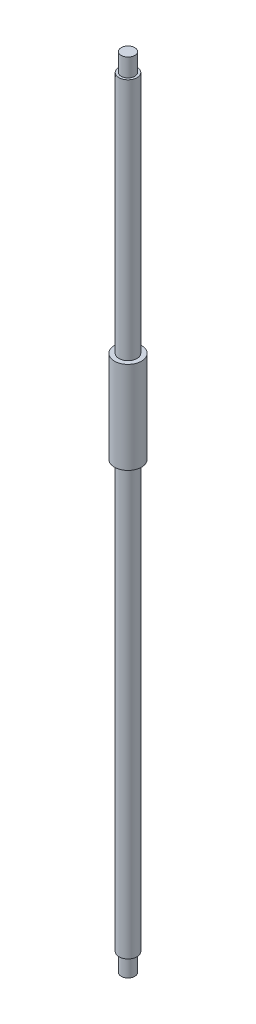
ISO-10303-21;
HEADER;
FILE_DESCRIPTION(('STEP AP214'),'2;1');
FILE_NAME('part.step','',(''),(''),'','','');
FILE_SCHEMA(('AUTOMOTIVE_DESIGN { 1 0 10303 214 1 1 1 1 }'));
ENDSEC;
DATA;
#1=APPLICATION_CONTEXT('core data for automotive mechanical design processes');
#2=APPLICATION_PROTOCOL_DEFINITION('international standard','automotive_design',2000,#1);
#3=PRODUCT_CONTEXT('',#1,'mechanical');
#4=PRODUCT('Part','Part','',(#3));
#5=PRODUCT_RELATED_PRODUCT_CATEGORY('part','',(#4));
#6=PRODUCT_DEFINITION_FORMATION('','',#4);
#7=PRODUCT_DEFINITION_CONTEXT('part definition',#1,'design');
#8=PRODUCT_DEFINITION('design','',#6,#7);
#9=PRODUCT_DEFINITION_SHAPE('','',#8);
#10=(LENGTH_UNIT() NAMED_UNIT(*) SI_UNIT(.MILLI.,.METRE.));
#11=(NAMED_UNIT(*) PLANE_ANGLE_UNIT() SI_UNIT($,.RADIAN.));
#12=(NAMED_UNIT(*) SI_UNIT($,.STERADIAN.) SOLID_ANGLE_UNIT());
#13=UNCERTAINTY_MEASURE_WITH_UNIT(LENGTH_MEASURE(1.E-05),#10,'distance_accuracy_value','');
#14=(GEOMETRIC_REPRESENTATION_CONTEXT(3) GLOBAL_UNCERTAINTY_ASSIGNED_CONTEXT((#13)) GLOBAL_UNIT_ASSIGNED_CONTEXT((#10,
#11,#12)) REPRESENTATION_CONTEXT('',''));
#15=CARTESIAN_POINT('',(0.,0.,0.));
#16=DIRECTION('',(0.,0.,1.));
#17=DIRECTION('',(1.,0.,0.));
#18=AXIS2_PLACEMENT_3D('',#15,#16,#17);
#19=CARTESIAN_POINT('',(0.,1120.,0.));
#20=DIRECTION('',(0.,-1.,0.));
#21=DIRECTION('',(0.,0.,-1.));
#22=AXIS2_PLACEMENT_3D('',#19,#20,#21);
#23=CYLINDRICAL_SURFACE('',#22,12.7);
#24=CARTESIAN_POINT('',(0.,25.4,0.));
#25=DIRECTION('',(0.,-1.,0.));
#26=DIRECTION('',(0.,0.,-1.));
#27=AXIS2_PLACEMENT_3D('',#24,#25,#26);
#28=CIRCLE('',#27,12.7);
#29=CARTESIAN_POINT('',(0.,25.4,-12.7));
#30=VERTEX_POINT('',#29);
#31=EDGE_CURVE('E44',#30,#30,#28,.T.);
#32=ORIENTED_EDGE('',*,*,#31,.F.);
#33=EDGE_LOOP('',(#32));
#34=FACE_BOUND('',#33,.T.);
#35=CARTESIAN_POINT('',(0.,624.,0.));
#36=DIRECTION('',(0.,1.,0.));
#37=DIRECTION('',(0.,0.,1.));
#38=AXIS2_PLACEMENT_3D('',#35,#36,#37);
#39=CIRCLE('',#38,12.7);
#40=CARTESIAN_POINT('',(0.,624.,12.7));
#41=VERTEX_POINT('',#40);
#42=EDGE_CURVE('E10',#41,#41,#39,.T.);
#43=ORIENTED_EDGE('',*,*,#42,.F.);
#44=EDGE_LOOP('',(#43));
#45=FACE_BOUND('',#44,.T.);
#46=ADVANCED_FACE('F37',(#34,#45),#23,.T.);
#47=CARTESIAN_POINT('',(0.,25.4,0.));
#48=DIRECTION('',(0.,-1.,0.));
#49=DIRECTION('',(0.,0.,-1.));
#50=AXIS2_PLACEMENT_3D('',#47,#48,#49);
#51=PLANE('',#50);
#52=CARTESIAN_POINT('',(0.,25.4,0.));
#53=DIRECTION('',(0.,-1.,0.));
#54=DIRECTION('',(0.,0.,-1.));
#55=AXIS2_PLACEMENT_3D('',#52,#53,#54);
#56=CIRCLE('',#55,9.525);
#57=CARTESIAN_POINT('',(0.,25.4,-9.525));
#58=VERTEX_POINT('',#57);
#59=EDGE_CURVE('E48',#58,#58,#56,.T.);
#60=ORIENTED_EDGE('',*,*,#59,.F.);
#61=EDGE_LOOP('',(#60));
#62=FACE_BOUND('',#61,.T.);
#63=ORIENTED_EDGE('',*,*,#31,.T.);
#64=EDGE_LOOP('',(#63));
#65=FACE_BOUND('',#64,.T.);
#66=ADVANCED_FACE('F100',(#62,#65),#51,.T.);
#67=CARTESIAN_POINT('',(0.,25.4,0.));
#68=DIRECTION('',(0.,-1.,0.));
#69=DIRECTION('',(0.,0.,-1.));
#70=AXIS2_PLACEMENT_3D('',#67,#68,#69);
#71=CYLINDRICAL_SURFACE('',#70,9.525);
#72=ORIENTED_EDGE('',*,*,#59,.T.);
#73=EDGE_LOOP('',(#72));
#74=FACE_BOUND('',#73,.T.);
#75=CARTESIAN_POINT('',(0.,0.,0.));
#76=DIRECTION('',(0.,-1.,0.));
#77=DIRECTION('',(0.,0.,-1.));
#78=AXIS2_PLACEMENT_3D('',#75,#76,#77);
#79=CIRCLE('',#78,9.525);
#80=CARTESIAN_POINT('',(0.,0.,-9.525));
#81=VERTEX_POINT('',#80);
#82=EDGE_CURVE('E52',#81,#81,#79,.T.);
#83=ORIENTED_EDGE('',*,*,#82,.F.);
#84=EDGE_LOOP('',(#83));
#85=FACE_BOUND('',#84,.T.);
#86=ADVANCED_FACE('F96',(#74,#85),#71,.T.);
#87=CARTESIAN_POINT('',(0.,0.,0.));
#88=DIRECTION('',(0.,1.,0.));
#89=DIRECTION('',(0.,0.,1.));
#90=AXIS2_PLACEMENT_3D('',#87,#88,#89);
#91=PLANE('',#90);
#92=ORIENTED_EDGE('',*,*,#82,.T.);
#93=EDGE_LOOP('',(#92));
#94=FACE_BOUND('',#93,.T.);
#95=ADVANCED_FACE('F88',(#94),#91,.F.);
#96=CARTESIAN_POINT('',(0.,624.,0.));
#97=DIRECTION('',(0.,1.,0.));
#98=DIRECTION('',(0.,0.,1.));
#99=AXIS2_PLACEMENT_3D('',#96,#97,#98);
#100=CYLINDRICAL_SURFACE('',#99,19.05);
#101=CARTESIAN_POINT('',(0.,624.,0.));
#102=DIRECTION('',(0.,1.,0.));
#103=DIRECTION('',(0.,0.,1.));
#104=AXIS2_PLACEMENT_3D('',#101,#102,#103);
#105=CIRCLE('',#104,19.05);
#106=CARTESIAN_POINT('',(0.,624.,19.05));
#107=VERTEX_POINT('',#106);
#108=EDGE_CURVE('E62',#107,#107,#105,.T.);
#109=ORIENTED_EDGE('',*,*,#108,.T.);
#110=EDGE_LOOP('',(#109));
#111=FACE_BOUND('',#110,.T.);
#112=CARTESIAN_POINT('',(0.,753.,0.));
#113=DIRECTION('',(0.,1.,0.));
#114=DIRECTION('',(0.,0.,1.));
#115=AXIS2_PLACEMENT_3D('',#112,#113,#114);
#116=CIRCLE('',#115,19.05);
#117=CARTESIAN_POINT('',(0.,753.,19.05));
#118=VERTEX_POINT('',#117);
#119=EDGE_CURVE('E67',#118,#118,#116,.T.);
#120=ORIENTED_EDGE('',*,*,#119,.F.);
#121=EDGE_LOOP('',(#120));
#122=FACE_BOUND('',#121,.T.);
#123=ADVANCED_FACE('F86',(#111,#122),#100,.T.);
#124=CARTESIAN_POINT('',(0.,624.,0.));
#125=DIRECTION('',(0.,1.,0.));
#126=DIRECTION('',(0.,0.,1.));
#127=AXIS2_PLACEMENT_3D('',#124,#125,#126);
#128=PLANE('',#127);
#129=ORIENTED_EDGE('',*,*,#42,.T.);
#130=EDGE_LOOP('',(#129));
#131=FACE_BOUND('',#130,.T.);
#132=ORIENTED_EDGE('',*,*,#108,.F.);
#133=EDGE_LOOP('',(#132));
#134=FACE_BOUND('',#133,.T.);
#135=ADVANCED_FACE('F82',(#131,#134),#128,.F.);
#136=CARTESIAN_POINT('',(0.,753.,0.));
#137=DIRECTION('',(0.,1.,0.));
#138=DIRECTION('',(0.,0.,1.));
#139=AXIS2_PLACEMENT_3D('',#136,#137,#138);
#140=PLANE('',#139);
#141=CARTESIAN_POINT('',(0.,753.,0.));
#142=DIRECTION('',(0.,1.,0.));
#143=DIRECTION('',(0.,0.,1.));
#144=AXIS2_PLACEMENT_3D('',#141,#142,#143);
#145=CIRCLE('',#144,12.7);
#146=CARTESIAN_POINT('',(0.,753.,12.7));
#147=VERTEX_POINT('',#146);
#148=EDGE_CURVE('E70',#147,#147,#145,.T.);
#149=ORIENTED_EDGE('',*,*,#148,.F.);
#150=EDGE_LOOP('',(#149));
#151=FACE_BOUND('',#150,.T.);
#152=ORIENTED_EDGE('',*,*,#119,.T.);
#153=EDGE_LOOP('',(#152));
#154=FACE_BOUND('',#153,.T.);
#155=ADVANCED_FACE('F78',(#151,#154),#140,.T.);
#156=CARTESIAN_POINT('',(0.,1120.,0.));
#157=DIRECTION('',(0.,1.,0.));
#158=DIRECTION('',(0.,0.,1.));
#159=AXIS2_PLACEMENT_3D('',#156,#157,#158);
#160=PLANE('',#159);
#161=CARTESIAN_POINT('',(0.,1120.,0.));
#162=DIRECTION('',(0.,1.,0.));
#163=DIRECTION('',(0.,0.,1.));
#164=AXIS2_PLACEMENT_3D('',#161,#162,#163);
#165=CIRCLE('',#164,9.525);
#166=CARTESIAN_POINT('',(0.,1120.,9.525));
#167=VERTEX_POINT('',#166);
#168=EDGE_CURVE('E58',#167,#167,#165,.T.);
#169=ORIENTED_EDGE('',*,*,#168,.T.);
#170=EDGE_LOOP('',(#169));
#171=FACE_BOUND('',#170,.T.);
#172=ADVANCED_FACE('F81',(#171),#160,.T.);
#173=CARTESIAN_POINT('',(0.,1094.6,0.));
#174=DIRECTION('',(0.,1.,0.));
#175=DIRECTION('',(0.,0.,1.));
#176=AXIS2_PLACEMENT_3D('',#173,#174,#175);
#177=CYLINDRICAL_SURFACE('',#176,9.525);
#178=CARTESIAN_POINT('',(0.,1094.6,0.));
#179=DIRECTION('',(0.,1.,0.));
#180=DIRECTION('',(0.,0.,1.));
#181=AXIS2_PLACEMENT_3D('',#178,#179,#180);
#182=CIRCLE('',#181,9.525);
#183=CARTESIAN_POINT('',(0.,1094.6,9.525));
#184=VERTEX_POINT('',#183);
#185=EDGE_CURVE('E61',#184,#184,#182,.T.);
#186=ORIENTED_EDGE('',*,*,#185,.T.);
#187=EDGE_LOOP('',(#186));
#188=FACE_BOUND('',#187,.T.);
#189=ORIENTED_EDGE('',*,*,#168,.F.);
#190=EDGE_LOOP('',(#189));
#191=FACE_BOUND('',#190,.T.);
#192=ADVANCED_FACE('F113',(#188,#191),#177,.T.);
#193=CARTESIAN_POINT('',(0.,1094.6,0.));
#194=DIRECTION('',(0.,1.,0.));
#195=DIRECTION('',(0.,0.,1.));
#196=AXIS2_PLACEMENT_3D('',#193,#194,#195);
#197=PLANE('',#196);
#198=ORIENTED_EDGE('',*,*,#185,.F.);
#199=EDGE_LOOP('',(#198));
#200=FACE_BOUND('',#199,.T.);
#201=CARTESIAN_POINT('',(0.,1094.6,0.));
#202=DIRECTION('',(0.,1.,0.));
#203=DIRECTION('',(0.,0.,1.));
#204=AXIS2_PLACEMENT_3D('',#201,#202,#203);
#205=CIRCLE('',#204,12.7);
#206=CARTESIAN_POINT('',(0.,1094.6,12.7));
#207=VERTEX_POINT('',#206);
#208=EDGE_CURVE('E56',#207,#207,#205,.T.);
#209=ORIENTED_EDGE('',*,*,#208,.T.);
#210=EDGE_LOOP('',(#209));
#211=FACE_BOUND('',#210,.T.);
#212=ADVANCED_FACE('F109',(#200,#211),#197,.T.);
#213=ORIENTED_EDGE('',*,*,#148,.T.);
#214=EDGE_LOOP('',(#213));
#215=FACE_BOUND('',#214,.T.);
#216=ORIENTED_EDGE('',*,*,#208,.F.);
#217=EDGE_LOOP('',(#216));
#218=FACE_BOUND('',#217,.T.);
#219=ADVANCED_FACE('F39',(#215,#218),#23,.T.);
#220=CLOSED_SHELL('',(#46,#66,#86,#95,#123,#135,#155,#172,#192,#212,#219));
#221=MANIFOLD_SOLID_BREP('B2',#220);
#222=ADVANCED_BREP_SHAPE_REPRESENTATION('',(#18,#221),#14);
#223=SHAPE_DEFINITION_REPRESENTATION(#9,#222);
ENDSEC;
END-ISO-10303-21;
